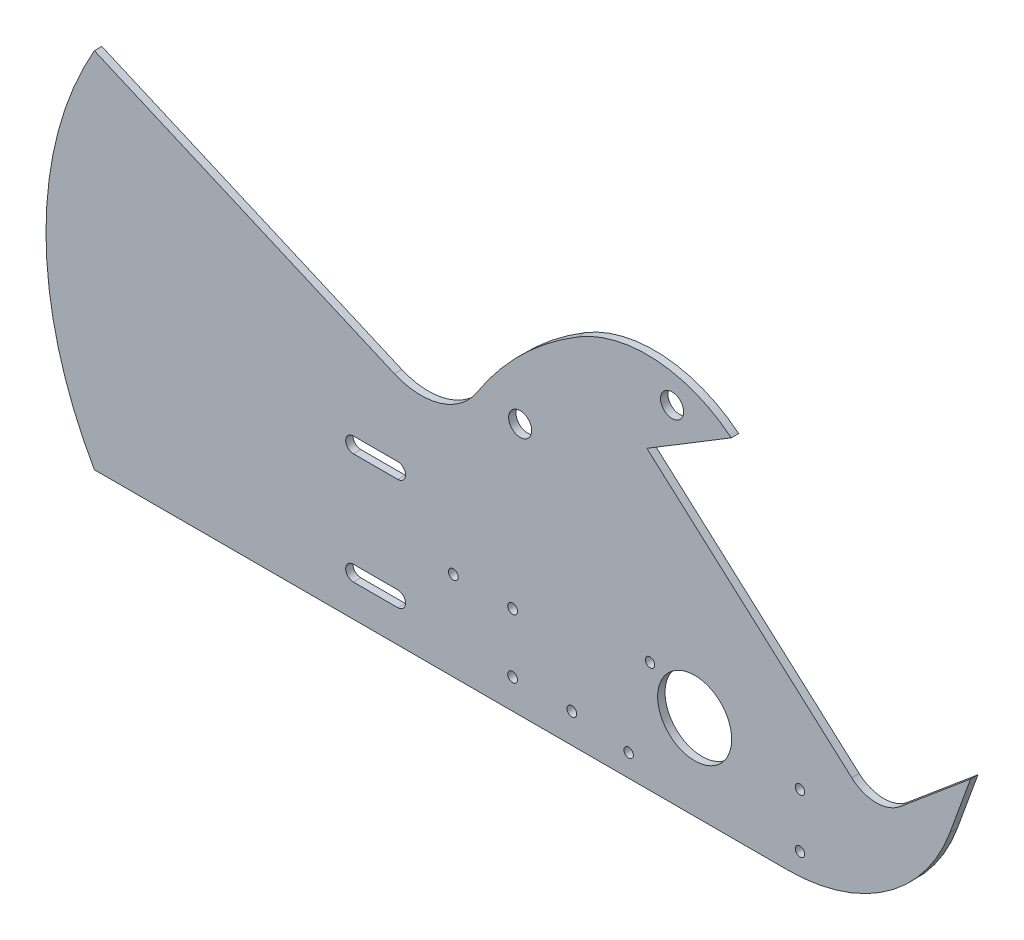
ISO-10303-21;
HEADER;
FILE_DESCRIPTION(('STEP AP214'),'2;1');
FILE_NAME('part.step','',(''),(''),'','','');
FILE_SCHEMA(('AUTOMOTIVE_DESIGN { 1 0 10303 214 1 1 1 1 }'));
ENDSEC;
DATA;
#1=APPLICATION_CONTEXT('core data for automotive mechanical design processes');
#2=APPLICATION_PROTOCOL_DEFINITION('international standard','automotive_design',2000,#1);
#3=PRODUCT_CONTEXT('',#1,'mechanical');
#4=PRODUCT('Part','Part','',(#3));
#5=PRODUCT_RELATED_PRODUCT_CATEGORY('part','',(#4));
#6=PRODUCT_DEFINITION_FORMATION('','',#4);
#7=PRODUCT_DEFINITION_CONTEXT('part definition',#1,'design');
#8=PRODUCT_DEFINITION('design','',#6,#7);
#9=PRODUCT_DEFINITION_SHAPE('','',#8);
#10=(LENGTH_UNIT() NAMED_UNIT(*) SI_UNIT(.MILLI.,.METRE.));
#11=(NAMED_UNIT(*) PLANE_ANGLE_UNIT() SI_UNIT($,.RADIAN.));
#12=(NAMED_UNIT(*) SI_UNIT($,.STERADIAN.) SOLID_ANGLE_UNIT());
#13=UNCERTAINTY_MEASURE_WITH_UNIT(LENGTH_MEASURE(1.E-05),#10,'distance_accuracy_value','');
#14=(GEOMETRIC_REPRESENTATION_CONTEXT(3) GLOBAL_UNCERTAINTY_ASSIGNED_CONTEXT((#13)) GLOBAL_UNIT_ASSIGNED_CONTEXT((#10,
#11,#12)) REPRESENTATION_CONTEXT('',''));
#15=CARTESIAN_POINT('',(0.,0.,0.));
#16=DIRECTION('',(0.,0.,1.));
#17=DIRECTION('',(1.,0.,0.));
#18=AXIS2_PLACEMENT_3D('',#15,#16,#17);
#19=CARTESIAN_POINT('',(-136.443129980913,87.2748774469459,3.175));
#20=DIRECTION('',(0.,0.,-1.));
#21=DIRECTION('',(-1.,0.,0.));
#22=AXIS2_PLACEMENT_3D('',#19,#20,#21);
#23=CYLINDRICAL_SURFACE('',#22,28.5749999999999);
#24=CARTESIAN_POINT('',(-136.443129980913,87.2748774469459,0.));
#25=DIRECTION('',(0.,0.,-1.));
#26=DIRECTION('',(1.,0.,0.));
#27=AXIS2_PLACEMENT_3D('',#24,#25,#26);
#28=CIRCLE('',#27,28.5749999999999);
#29=CARTESIAN_POINT('',(-112.371322470553,71.877517017828,0.));
#30=VERTEX_POINT('',#29);
#31=CARTESIAN_POINT('',(-147.787037556841,61.048051754369,0.));
#32=VERTEX_POINT('',#31);
#33=EDGE_CURVE('E258',#30,#32,#28,.T.);
#34=ORIENTED_EDGE('',*,*,#33,.T.);
#35=DIRECTION('',(0.,0.,-1.));
#36=VECTOR('',#35,1.);
#37=CARTESIAN_POINT('',(-147.787037556841,61.048051754369,3.175));
#38=LINE('',#37,#36);
#39=CARTESIAN_POINT('',(-147.787037556841,61.048051754369,3.175));
#40=VERTEX_POINT('',#39);
#41=EDGE_CURVE('E11',#40,#32,#38,.T.);
#42=ORIENTED_EDGE('',*,*,#41,.F.);
#43=CARTESIAN_POINT('',(-136.443129980913,87.2748774469459,3.175));
#44=DIRECTION('',(0.,0.,-1.));
#45=DIRECTION('',(1.,0.,0.));
#46=AXIS2_PLACEMENT_3D('',#43,#44,#45);
#47=CIRCLE('',#46,28.5749999999999);
#48=CARTESIAN_POINT('',(-112.371322470553,71.877517017828,3.175));
#49=VERTEX_POINT('',#48);
#50=EDGE_CURVE('E261',#49,#40,#47,.T.);
#51=ORIENTED_EDGE('',*,*,#50,.F.);
#52=DIRECTION('',(0.,0.,-1.));
#53=VECTOR('',#52,1.);
#54=CARTESIAN_POINT('',(-112.371322470553,71.877517017828,3.175));
#55=LINE('',#54,#53);
#56=EDGE_CURVE('E287',#49,#30,#55,.T.);
#57=ORIENTED_EDGE('',*,*,#56,.T.);
#58=EDGE_LOOP('',(#34,#42,#51,#57));
#59=FACE_BOUND('',#58,.T.);
#60=ADVANCED_FACE('F34',(#59),#23,.F.);
#61=CARTESIAN_POINT('',(-177.372260989397,73.8445694941068,3.175));
#62=DIRECTION('',(-0.396987141764733,-0.917824171218795,0.));
#63=DIRECTION('',(0.917824171218795,-0.396987141764733,0.));
#64=AXIS2_PLACEMENT_3D('',#61,#62,#63);
#65=PLANE('',#64);
#66=DIRECTION('',(-0.917824171218795,0.396987141764733,0.));
#67=VECTOR('',#66,1.);
#68=CARTESIAN_POINT('',(-177.372260989397,73.8445694941068,0.));
#69=LINE('',#68,#67);
#70=CARTESIAN_POINT('',(-276.451380272466,116.69933144761,0.));
#71=VERTEX_POINT('',#70);
#72=EDGE_CURVE('E290',#32,#71,#69,.T.);
#73=ORIENTED_EDGE('',*,*,#72,.T.);
#74=DIRECTION('',(0.,0.,-1.));
#75=VECTOR('',#74,1.);
#76=CARTESIAN_POINT('',(-276.451380272466,116.69933144761,3.175));
#77=LINE('',#76,#75);
#78=CARTESIAN_POINT('',(-276.451380272466,116.69933144761,3.175));
#79=VERTEX_POINT('',#78);
#80=EDGE_CURVE('E41',#79,#71,#77,.T.);
#81=ORIENTED_EDGE('',*,*,#80,.F.);
#82=DIRECTION('',(-0.917824171218795,0.396987141764733,0.));
#83=VECTOR('',#82,1.);
#84=CARTESIAN_POINT('',(-177.372260989397,73.8445694941068,3.175));
#85=LINE('',#84,#83);
#86=EDGE_CURVE('E264',#40,#79,#85,.T.);
#87=ORIENTED_EDGE('',*,*,#86,.F.);
#88=ORIENTED_EDGE('',*,*,#41,.T.);
#89=EDGE_LOOP('',(#73,#81,#87,#88));
#90=FACE_BOUND('',#89,.T.);
#91=ADVANCED_FACE('F366',(#90),#65,.F.);
#92=CARTESIAN_POINT('',(-140.78574748454,38.8840092455691,3.175));
#93=DIRECTION('',(0.,0.,-1.));
#94=DIRECTION('',(-1.,0.,0.));
#95=AXIS2_PLACEMENT_3D('',#92,#93,#94);
#96=CYLINDRICAL_SURFACE('',#95,156.39817226923);
#97=CARTESIAN_POINT('',(-140.78574748454,38.8840092455691,0.));
#98=DIRECTION('',(0.,0.,1.));
#99=DIRECTION('',(1.,0.,0.));
#100=AXIS2_PLACEMENT_3D('',#97,#98,#99);
#101=CIRCLE('',#100,156.39817226923);
#102=CARTESIAN_POINT('',(-276.451380272466,-38.9313129564715,0.));
#103=VERTEX_POINT('',#102);
#104=EDGE_CURVE('E292',#71,#103,#101,.T.);
#105=ORIENTED_EDGE('',*,*,#104,.T.);
#106=DIRECTION('',(0.,0.,-1.));
#107=VECTOR('',#106,1.);
#108=CARTESIAN_POINT('',(-276.451380272466,-38.9313129564715,3.175));
#109=LINE('',#108,#107);
#110=CARTESIAN_POINT('',(-276.451380272466,-38.9313129564715,3.175));
#111=VERTEX_POINT('',#110);
#112=EDGE_CURVE('E338',#111,#103,#109,.T.);
#113=ORIENTED_EDGE('',*,*,#112,.F.);
#114=CARTESIAN_POINT('',(-140.78574748454,38.8840092455691,3.175));
#115=DIRECTION('',(0.,0.,1.));
#116=DIRECTION('',(1.,0.,0.));
#117=AXIS2_PLACEMENT_3D('',#114,#115,#116);
#118=CIRCLE('',#117,156.39817226923);
#119=EDGE_CURVE('E267',#79,#111,#118,.T.);
#120=ORIENTED_EDGE('',*,*,#119,.F.);
#121=ORIENTED_EDGE('',*,*,#80,.T.);
#122=EDGE_LOOP('',(#105,#113,#120,#121));
#123=FACE_BOUND('',#122,.T.);
#124=ADVANCED_FACE('F345',(#123),#96,.T.);
#125=CARTESIAN_POINT('',(-127.585439756714,-38.9313129564715,3.175));
#126=DIRECTION('',(0.,1.,0.));
#127=DIRECTION('',(-1.,0.,0.));
#128=AXIS2_PLACEMENT_3D('',#125,#126,#127);
#129=PLANE('',#128);
#130=DIRECTION('',(1.,0.,0.));
#131=VECTOR('',#130,1.);
#132=CARTESIAN_POINT('',(-127.585439756714,-38.9313129564715,0.));
#133=LINE('',#132,#131);
#134=CARTESIAN_POINT('',(20.8959123706932,-38.9313129564715,0.));
#135=VERTEX_POINT('',#134);
#136=EDGE_CURVE('E295',#103,#135,#133,.T.);
#137=ORIENTED_EDGE('',*,*,#136,.T.);
#138=DIRECTION('',(0.,0.,-1.));
#139=VECTOR('',#138,1.);
#140=CARTESIAN_POINT('',(20.8959123706932,-38.9313129564715,3.175));
#141=LINE('',#140,#139);
#142=CARTESIAN_POINT('',(20.8959123706932,-38.9313129564715,3.175));
#143=VERTEX_POINT('',#142);
#144=EDGE_CURVE('E335',#143,#135,#141,.T.);
#145=ORIENTED_EDGE('',*,*,#144,.F.);
#146=DIRECTION('',(1.,0.,0.));
#147=VECTOR('',#146,1.);
#148=CARTESIAN_POINT('',(-127.585439756714,-38.9313129564715,3.175));
#149=LINE('',#148,#147);
#150=EDGE_CURVE('E269',#111,#143,#149,.T.);
#151=ORIENTED_EDGE('',*,*,#150,.F.);
#152=ORIENTED_EDGE('',*,*,#112,.T.);
#153=EDGE_LOOP('',(#137,#145,#151,#152));
#154=FACE_BOUND('',#153,.T.);
#155=ADVANCED_FACE('F355',(#154),#129,.F.);
#156=CARTESIAN_POINT('',(20.8959123706932,35.0312861178766,3.175));
#157=DIRECTION('',(0.,0.,-1.));
#158=DIRECTION('',(-1.,0.,0.));
#159=AXIS2_PLACEMENT_3D('',#156,#157,#158);
#160=CYLINDRICAL_SURFACE('',#159,73.9625990743481);
#161=CARTESIAN_POINT('',(20.8959123706932,35.0312861178766,0.));
#162=DIRECTION('',(0.,0.,1.));
#163=DIRECTION('',(1.,0.,0.));
#164=AXIS2_PLACEMENT_3D('',#161,#162,#163);
#165=CIRCLE('',#164,73.9625990743481);
#166=CARTESIAN_POINT('',(90.3980209350046,9.7345873817289,0.));
#167=VERTEX_POINT('',#166);
#168=EDGE_CURVE('E297',#135,#167,#165,.T.);
#169=ORIENTED_EDGE('',*,*,#168,.T.);
#170=DIRECTION('',(0.,0.,-1.));
#171=VECTOR('',#170,1.);
#172=CARTESIAN_POINT('',(90.3980209350046,9.7345873817289,3.175));
#173=LINE('',#172,#171);
#174=CARTESIAN_POINT('',(90.3980209350046,9.7345873817289,3.175));
#175=VERTEX_POINT('',#174);
#176=EDGE_CURVE('E332',#175,#167,#173,.T.);
#177=ORIENTED_EDGE('',*,*,#176,.F.);
#178=CARTESIAN_POINT('',(20.8959123706932,35.0312861178766,3.175));
#179=DIRECTION('',(0.,0.,1.));
#180=DIRECTION('',(1.,0.,0.));
#181=AXIS2_PLACEMENT_3D('',#178,#179,#180);
#182=CIRCLE('',#181,73.9625990743481);
#183=EDGE_CURVE('E271',#143,#175,#182,.T.);
#184=ORIENTED_EDGE('',*,*,#183,.F.);
#185=ORIENTED_EDGE('',*,*,#144,.T.);
#186=EDGE_LOOP('',(#169,#177,#184,#185));
#187=FACE_BOUND('',#186,.T.);
#188=ADVANCED_FACE('F359',(#187),#160,.T.);
#189=CARTESIAN_POINT('',(99.2640081454237,34.0936870435286,3.175));
#190=DIRECTION('',(-0.939692620785907,0.342020143325672,0.));
#191=DIRECTION('',(-0.342020143325672,-0.939692620785907,0.));
#192=AXIS2_PLACEMENT_3D('',#189,#190,#191);
#193=PLANE('',#192);
#194=DIRECTION('',(0.342020143325672,0.939692620785907,0.));
#195=VECTOR('',#194,1.);
#196=CARTESIAN_POINT('',(99.2640081454237,34.0936870435286,0.));
#197=LINE('',#196,#195);
#198=CARTESIAN_POINT('',(99.2640081454237,34.0936870435286,0.));
#199=VERTEX_POINT('',#198);
#200=EDGE_CURVE('E299',#167,#199,#197,.T.);
#201=ORIENTED_EDGE('',*,*,#200,.T.);
#202=DIRECTION('',(0.,0.,-1.));
#203=VECTOR('',#202,1.);
#204=CARTESIAN_POINT('',(99.2640081454237,34.0936870435286,3.175));
#205=LINE('',#204,#203);
#206=CARTESIAN_POINT('',(99.2640081454237,34.0936870435286,3.175));
#207=VERTEX_POINT('',#206);
#208=EDGE_CURVE('E329',#207,#199,#205,.T.);
#209=ORIENTED_EDGE('',*,*,#208,.F.);
#210=DIRECTION('',(0.342020143325672,0.939692620785907,0.));
#211=VECTOR('',#210,1.);
#212=CARTESIAN_POINT('',(99.2640081454237,34.0936870435286,3.175));
#213=LINE('',#212,#211);
#214=EDGE_CURVE('E273',#175,#207,#213,.T.);
#215=ORIENTED_EDGE('',*,*,#214,.F.);
#216=ORIENTED_EDGE('',*,*,#176,.T.);
#217=EDGE_LOOP('',(#201,#209,#215,#216));
#218=FACE_BOUND('',#217,.T.);
#219=ADVANCED_FACE('F399',(#218),#193,.F.);
#220=CARTESIAN_POINT('',(69.0694214876391,8.75742051543091,3.175));
#221=DIRECTION('',(0.642787609686541,-0.766044443118976,0.));
#222=DIRECTION('',(0.766044443118977,0.642787609686541,0.));
#223=AXIS2_PLACEMENT_3D('',#220,#221,#222);
#224=PLANE('',#223);
#225=DIRECTION('',(-0.766044443118976,-0.642787609686541,0.));
#226=VECTOR('',#225,1.);
#227=CARTESIAN_POINT('',(69.0694214876391,8.75742051543091,0.));
#228=LINE('',#227,#226);
#229=CARTESIAN_POINT('',(69.0694214876391,8.75742051543091,0.));
#230=VERTEX_POINT('',#229);
#231=EDGE_CURVE('E301',#199,#230,#228,.T.);
#232=ORIENTED_EDGE('',*,*,#231,.T.);
#233=DIRECTION('',(0.,0.,-1.));
#234=VECTOR('',#233,1.);
#235=CARTESIAN_POINT('',(69.0694214876391,8.75742051543091,3.175));
#236=LINE('',#235,#234);
#237=CARTESIAN_POINT('',(69.0694214876391,8.75742051543091,3.175));
#238=VERTEX_POINT('',#237);
#239=EDGE_CURVE('E326',#238,#230,#236,.T.);
#240=ORIENTED_EDGE('',*,*,#239,.F.);
#241=DIRECTION('',(-0.766044443118976,-0.642787609686541,0.));
#242=VECTOR('',#241,1.);
#243=CARTESIAN_POINT('',(69.0694214876391,8.75742051543091,3.175));
#244=LINE('',#243,#242);
#245=EDGE_CURVE('E275',#207,#238,#244,.T.);
#246=ORIENTED_EDGE('',*,*,#245,.F.);
#247=ORIENTED_EDGE('',*,*,#208,.T.);
#248=EDGE_LOOP('',(#232,#240,#246,#247));
#249=FACE_BOUND('',#248,.T.);
#250=ADVANCED_FACE('F397',(#249),#224,.F.);
#251=CARTESIAN_POINT('',(58.8651681838657,20.9183760499451,3.175));
#252=DIRECTION('',(0.,0.,-1.));
#253=DIRECTION('',(-1.,0.,0.));
#254=AXIS2_PLACEMENT_3D('',#251,#252,#253);
#255=CYLINDRICAL_SURFACE('',#254,15.8750000000003);
#256=CARTESIAN_POINT('',(58.8651681838657,20.9183760499451,0.));
#257=DIRECTION('',(0.,0.,-1.));
#258=DIRECTION('',(-1.,0.,0.));
#259=AXIS2_PLACEMENT_3D('',#256,#257,#258);
#260=CIRCLE('',#259,15.8750000000003);
#261=CARTESIAN_POINT('',(48.2932034747206,9.07569108459201,0.));
#262=VERTEX_POINT('',#261);
#263=EDGE_CURVE('E303',#230,#262,#260,.T.);
#264=ORIENTED_EDGE('',*,*,#263,.T.);
#265=DIRECTION('',(0.,0.,-1.));
#266=VECTOR('',#265,1.);
#267=CARTESIAN_POINT('',(48.2932034747206,9.07569108459201,3.175));
#268=LINE('',#267,#266);
#269=CARTESIAN_POINT('',(48.2932034747206,9.07569108459201,3.175));
#270=VERTEX_POINT('',#269);
#271=EDGE_CURVE('E323',#270,#262,#268,.T.);
#272=ORIENTED_EDGE('',*,*,#271,.F.);
#273=CARTESIAN_POINT('',(58.8651681838657,20.9183760499451,3.175));
#274=DIRECTION('',(0.,0.,-1.));
#275=DIRECTION('',(-1.,0.,0.));
#276=AXIS2_PLACEMENT_3D('',#273,#274,#275);
#277=CIRCLE('',#276,15.8750000000003);
#278=EDGE_CURVE('E277',#238,#270,#277,.T.);
#279=ORIENTED_EDGE('',*,*,#278,.F.);
#280=ORIENTED_EDGE('',*,*,#239,.T.);
#281=EDGE_LOOP('',(#264,#272,#279,#280));
#282=FACE_BOUND('',#281,.T.);
#283=ADVANCED_FACE('F393',(#282),#255,.F.);
#284=CARTESIAN_POINT('',(48.2932034747204,9.07569108459179,3.175));
#285=DIRECTION('',(-0.665950532859554,-0.745995903329285,0.));
#286=DIRECTION('',(0.745995903329285,-0.665950532859554,0.));
#287=AXIS2_PLACEMENT_3D('',#284,#285,#286);
#288=PLANE('',#287);
#289=DIRECTION('',(-0.745995903329285,0.665950532859554,0.));
#290=VECTOR('',#289,1.);
#291=CARTESIAN_POINT('',(48.2932034747204,9.07569108459179,0.));
#292=LINE('',#291,#290);
#293=CARTESIAN_POINT('',(-39.5356826795893,87.4805365722031,0.));
#294=VERTEX_POINT('',#293);
#295=EDGE_CURVE('E305',#262,#294,#292,.T.);
#296=ORIENTED_EDGE('',*,*,#295,.T.);
#297=DIRECTION('',(0.,0.,-1.));
#298=VECTOR('',#297,1.);
#299=CARTESIAN_POINT('',(-39.5356826795893,87.4805365722031,3.175));
#300=LINE('',#299,#298);
#301=CARTESIAN_POINT('',(-39.5356826795893,87.4805365722031,3.175));
#302=VERTEX_POINT('',#301);
#303=EDGE_CURVE('E320',#302,#294,#300,.T.);
#304=ORIENTED_EDGE('',*,*,#303,.F.);
#305=DIRECTION('',(-0.745995903329285,0.665950532859554,0.));
#306=VECTOR('',#305,1.);
#307=CARTESIAN_POINT('',(48.2932034747204,9.07569108459179,3.175));
#308=LINE('',#307,#306);
#309=EDGE_CURVE('E279',#270,#302,#308,.T.);
#310=ORIENTED_EDGE('',*,*,#309,.F.);
#311=ORIENTED_EDGE('',*,*,#271,.T.);
#312=EDGE_LOOP('',(#296,#304,#310,#311));
#313=FACE_BOUND('',#312,.T.);
#314=ADVANCED_FACE('F388',(#313),#288,.F.);
#315=CARTESIAN_POINT('',(-3.34071269482263,109.466412575739,3.175));
#316=DIRECTION('',(-0.51915684100474,0.854678989116955,0.));
#317=DIRECTION('',(-0.854678989116955,-0.51915684100474,0.));
#318=AXIS2_PLACEMENT_3D('',#315,#316,#317);
#319=PLANE('',#318);
#320=DIRECTION('',(0.854678989116955,0.51915684100474,0.));
#321=VECTOR('',#320,1.);
#322=CARTESIAN_POINT('',(-3.34071269482263,109.466412575739,0.));
#323=LINE('',#322,#321);
#324=CARTESIAN_POINT('',(-3.34071269482263,109.466412575739,0.));
#325=VERTEX_POINT('',#324);
#326=EDGE_CURVE('E307',#294,#325,#323,.T.);
#327=ORIENTED_EDGE('',*,*,#326,.T.);
#328=DIRECTION('',(0.,0.,-1.));
#329=VECTOR('',#328,1.);
#330=CARTESIAN_POINT('',(-3.34071269482263,109.466412575739,3.175));
#331=LINE('',#330,#329);
#332=CARTESIAN_POINT('',(-3.34071269482263,109.466412575739,3.175));
#333=VERTEX_POINT('',#332);
#334=EDGE_CURVE('E317',#333,#325,#331,.T.);
#335=ORIENTED_EDGE('',*,*,#334,.F.);
#336=DIRECTION('',(0.854678989116955,0.51915684100474,0.));
#337=VECTOR('',#336,1.);
#338=CARTESIAN_POINT('',(-3.34071269482263,109.466412575739,3.175));
#339=LINE('',#338,#337);
#340=EDGE_CURVE('E281',#302,#333,#339,.T.);
#341=ORIENTED_EDGE('',*,*,#340,.F.);
#342=ORIENTED_EDGE('',*,*,#303,.T.);
#343=EDGE_LOOP('',(#327,#335,#341,#342));
#344=FACE_BOUND('',#343,.T.);
#345=ADVANCED_FACE('F382',(#344),#319,.F.);
#346=CARTESIAN_POINT('',(-39.5133931875119,65.0502204318948,3.175));
#347=DIRECTION('',(0.,0.,-1.));
#348=DIRECTION('',(-1.,0.,0.));
#349=AXIS2_PLACEMENT_3D('',#346,#347,#348);
#350=CYLINDRICAL_SURFACE('',#349,57.2822916666667);
#351=CARTESIAN_POINT('',(-39.5133931875119,65.0502204318948,0.));
#352=DIRECTION('',(0.,0.,1.));
#353=DIRECTION('',(-1.,0.,0.));
#354=AXIS2_PLACEMENT_3D('',#351,#352,#353);
#355=CIRCLE('',#354,57.2822916666667);
#356=CARTESIAN_POINT('',(-69.2518867746906,114.008191567864,0.));
#357=VERTEX_POINT('',#356);
#358=EDGE_CURVE('E309',#325,#357,#355,.T.);
#359=ORIENTED_EDGE('',*,*,#358,.T.);
#360=DIRECTION('',(0.,0.,-1.));
#361=VECTOR('',#360,1.);
#362=CARTESIAN_POINT('',(-69.2518867746906,114.008191567864,3.175));
#363=LINE('',#362,#361);
#364=CARTESIAN_POINT('',(-69.2518867746906,114.008191567864,3.175));
#365=VERTEX_POINT('',#364);
#366=EDGE_CURVE('E314',#365,#357,#363,.T.);
#367=ORIENTED_EDGE('',*,*,#366,.F.);
#368=CARTESIAN_POINT('',(-39.5133931875119,65.0502204318948,3.175));
#369=DIRECTION('',(0.,0.,1.));
#370=DIRECTION('',(-1.,0.,0.));
#371=AXIS2_PLACEMENT_3D('',#368,#369,#370);
#372=CIRCLE('',#371,57.2822916666667);
#373=EDGE_CURVE('E283',#333,#365,#372,.T.);
#374=ORIENTED_EDGE('',*,*,#373,.F.);
#375=ORIENTED_EDGE('',*,*,#334,.T.);
#376=EDGE_LOOP('',(#359,#367,#374,#375));
#377=FACE_BOUND('',#376,.T.);
#378=ADVANCED_FACE('F378',(#377),#350,.T.);
#379=CARTESIAN_POINT('',(3.37230243729891E-12,-1.56819002228303E-12,3.175));
#380=DIRECTION('',(0.,0.,-1.));
#381=DIRECTION('',(-1.,0.,0.));
#382=AXIS2_PLACEMENT_3D('',#379,#380,#381);
#383=CYLINDRICAL_SURFACE('',#382,133.392996691844);
#384=CARTESIAN_POINT('',(3.37230243729891E-12,-1.56819002228303E-12,0.));
#385=DIRECTION('',(0.,0.,1.));
#386=DIRECTION('',(-1.,0.,0.));
#387=AXIS2_PLACEMENT_3D('',#384,#385,#386);
#388=CIRCLE('',#387,133.392996691844);
#389=EDGE_CURVE('E265',#357,#30,#388,.T.);
#390=ORIENTED_EDGE('',*,*,#389,.T.);
#391=ORIENTED_EDGE('',*,*,#56,.F.);
#392=CARTESIAN_POINT('',(3.37230243729891E-12,-1.56819002228303E-12,3.175));
#393=DIRECTION('',(0.,0.,1.));
#394=DIRECTION('',(-1.,0.,0.));
#395=AXIS2_PLACEMENT_3D('',#392,#393,#394);
#396=CIRCLE('',#395,133.392996691844);
#397=EDGE_CURVE('E285',#365,#49,#396,.T.);
#398=ORIENTED_EDGE('',*,*,#397,.F.);
#399=ORIENTED_EDGE('',*,*,#366,.T.);
#400=EDGE_LOOP('',(#390,#391,#398,#399));
#401=FACE_BOUND('',#400,.T.);
#402=ADVANCED_FACE('F373',(#401),#383,.T.);
#403=CARTESIAN_POINT('',(-136.443129980913,87.2748774469459,3.175));
#404=DIRECTION('',(0.,0.,1.));
#405=DIRECTION('',(1.,0.,0.));
#406=AXIS2_PLACEMENT_3D('',#403,#404,#405);
#407=PLANE('',#406);
#408=CARTESIAN_POINT('',(-28.7407126948226,108.897095010061,3.175));
#409=DIRECTION('',(0.,0.,1.));
#410=DIRECTION('',(1.,0.,0.));
#411=AXIS2_PLACEMENT_3D('',#408,#409,#410);
#412=CIRCLE('',#411,4.961001);
#413=CARTESIAN_POINT('',(-23.7797116948226,108.897095010061,3.175));
#414=VERTEX_POINT('',#413);
#415=EDGE_CURVE('E692',#414,#414,#412,.T.);
#416=ORIENTED_EDGE('',*,*,#415,.F.);
#417=EDGE_LOOP('',(#416));
#418=FACE_BOUND('',#417,.T.);
#419=CARTESIAN_POINT('',(-93.8672516655346,69.3373437254997,3.175));
#420=DIRECTION('',(0.,0.,1.));
#421=DIRECTION('',(1.,0.,0.));
#422=AXIS2_PLACEMENT_3D('',#419,#420,#421);
#423=CIRCLE('',#422,4.96100099999999);
#424=CARTESIAN_POINT('',(-88.9062506655346,69.3373437254997,3.175));
#425=VERTEX_POINT('',#424);
#426=EDGE_CURVE('E694',#425,#425,#423,.T.);
#427=ORIENTED_EDGE('',*,*,#426,.F.);
#428=EDGE_LOOP('',(#427));
#429=FACE_BOUND('',#428,.T.);
#430=CARTESIAN_POINT('',(-38.1908667013556,8.69368704352845,3.175));
#431=DIRECTION('',(0.,0.,1.));
#432=DIRECTION('',(1.,0.,0.));
#433=AXIS2_PLACEMENT_3D('',#430,#431,#432);
#434=CIRCLE('',#433,2.01929999999999);
#435=CARTESIAN_POINT('',(-36.1715667013556,8.69368704352845,3.175));
#436=VERTEX_POINT('',#435);
#437=EDGE_CURVE('E703',#436,#436,#434,.T.);
#438=ORIENTED_EDGE('',*,*,#437,.F.);
#439=EDGE_LOOP('',(#438));
#440=FACE_BOUND('',#439,.T.);
#441=CARTESIAN_POINT('',(-47.354412394006,-29.4063129564715,3.175));
#442=DIRECTION('',(0.,0.,1.));
#443=DIRECTION('',(1.,0.,0.));
#444=AXIS2_PLACEMENT_3D('',#441,#442,#443);
#445=CIRCLE('',#444,2.01929999999999);
#446=CARTESIAN_POINT('',(-45.335112394006,-29.4063129564715,3.175));
#447=VERTEX_POINT('',#446);
#448=EDGE_CURVE('E711',#447,#447,#445,.T.);
#449=ORIENTED_EDGE('',*,*,#448,.F.);
#450=EDGE_LOOP('',(#449));
#451=FACE_BOUND('',#450,.T.);
#452=CARTESIAN_POINT('',(26.1115835914491,-29.4063129564716,3.175));
#453=DIRECTION('',(0.,0.,1.));
#454=DIRECTION('',(1.,0.,0.));
#455=AXIS2_PLACEMENT_3D('',#452,#453,#454);
#456=CIRCLE('',#455,2.0193);
#457=CARTESIAN_POINT('',(28.1308835914491,-29.4063129564716,3.175));
#458=VERTEX_POINT('',#457);
#459=EDGE_CURVE('E702',#458,#458,#456,.T.);
#460=ORIENTED_EDGE('',*,*,#459,.F.);
#461=EDGE_LOOP('',(#460));
#462=FACE_BOUND('',#461,.T.);
#463=CARTESIAN_POINT('',(26.1115835914491,-6.33057427050274,3.175));
#464=DIRECTION('',(0.,0.,1.));
#465=DIRECTION('',(1.,0.,0.));
#466=AXIS2_PLACEMENT_3D('',#463,#464,#465);
#467=CIRCLE('',#466,2.0193);
#468=CARTESIAN_POINT('',(28.1308835914491,-6.33057427050274,3.175));
#469=VERTEX_POINT('',#468);
#470=EDGE_CURVE('E710',#469,#469,#467,.T.);
#471=ORIENTED_EDGE('',*,*,#470,.F.);
#472=EDGE_LOOP('',(#471));
#473=FACE_BOUND('',#472,.T.);
#474=CARTESIAN_POINT('',(-146.337218926204,25.8386870435285,3.175));
#475=DIRECTION('',(0.,0.,1.));
#476=DIRECTION('',(1.,0.,0.));
#477=AXIS2_PLACEMENT_3D('',#474,#475,#476);
#478=CIRCLE('',#477,3.302);
#479=CARTESIAN_POINT('',(-146.337218926204,22.5366870435285,3.175));
#480=VERTEX_POINT('',#479);
#481=CARTESIAN_POINT('',(-146.337218926204,29.1406870435285,3.175));
#482=VERTEX_POINT('',#481);
#483=EDGE_CURVE('E48',#480,#482,#478,.T.);
#484=ORIENTED_EDGE('',*,*,#483,.F.);
#485=DIRECTION('',(1.,0.,0.));
#486=VECTOR('',#485,1.);
#487=CARTESIAN_POINT('',(-165.387218926204,22.5366870435285,3.175));
#488=LINE('',#487,#486);
#489=CARTESIAN_POINT('',(-165.387218926204,22.5366870435285,3.175));
#490=VERTEX_POINT('',#489);
#491=EDGE_CURVE('E189',#490,#480,#488,.T.);
#492=ORIENTED_EDGE('',*,*,#491,.F.);
#493=CARTESIAN_POINT('',(-165.387218926204,25.8386870435285,3.175));
#494=DIRECTION('',(0.,0.,1.));
#495=DIRECTION('',(1.,0.,0.));
#496=AXIS2_PLACEMENT_3D('',#493,#494,#495);
#497=CIRCLE('',#496,3.302);
#498=CARTESIAN_POINT('',(-165.387218926204,29.1406870435285,3.175));
#499=VERTEX_POINT('',#498);
#500=EDGE_CURVE('E173',#499,#490,#497,.T.);
#501=ORIENTED_EDGE('',*,*,#500,.F.);
#502=DIRECTION('',(-1.,0.,0.));
#503=VECTOR('',#502,1.);
#504=CARTESIAN_POINT('',(-165.387218926204,29.1406870435285,3.175));
#505=LINE('',#504,#503);
#506=EDGE_CURVE('E182',#482,#499,#505,.T.);
#507=ORIENTED_EDGE('',*,*,#506,.F.);
#508=EDGE_LOOP('',(#484,#492,#501,#507));
#509=FACE_BOUND('',#508,.T.);
#510=CARTESIAN_POINT('',(-165.387218926204,-21.7863129564715,3.175));
#511=DIRECTION('',(0.,0.,1.));
#512=DIRECTION('',(1.,0.,0.));
#513=AXIS2_PLACEMENT_3D('',#510,#511,#512);
#514=CIRCLE('',#513,3.302);
#515=CARTESIAN_POINT('',(-165.387218926204,-18.4843129564715,3.175));
#516=VERTEX_POINT('',#515);
#517=CARTESIAN_POINT('',(-165.387218926204,-25.0883129564715,3.175));
#518=VERTEX_POINT('',#517);
#519=EDGE_CURVE('E200',#516,#518,#514,.T.);
#520=ORIENTED_EDGE('',*,*,#519,.F.);
#521=DIRECTION('',(-1.,0.,0.));
#522=VECTOR('',#521,1.);
#523=CARTESIAN_POINT('',(-165.387218926204,-18.4843129564715,3.175));
#524=LINE('',#523,#522);
#525=CARTESIAN_POINT('',(-146.337218926204,-18.4843129564715,3.175));
#526=VERTEX_POINT('',#525);
#527=EDGE_CURVE('E218',#526,#516,#524,.T.);
#528=ORIENTED_EDGE('',*,*,#527,.F.);
#529=CARTESIAN_POINT('',(-146.337218926204,-21.7863129564715,3.175));
#530=DIRECTION('',(0.,0.,1.));
#531=DIRECTION('',(1.,0.,0.));
#532=AXIS2_PLACEMENT_3D('',#529,#530,#531);
#533=CIRCLE('',#532,3.302);
#534=CARTESIAN_POINT('',(-146.337218926204,-25.0883129564715,3.175));
#535=VERTEX_POINT('',#534);
#536=EDGE_CURVE('E215',#535,#526,#533,.T.);
#537=ORIENTED_EDGE('',*,*,#536,.F.);
#538=DIRECTION('',(1.,0.,0.));
#539=VECTOR('',#538,1.);
#540=CARTESIAN_POINT('',(-165.387218926204,-25.0883129564715,3.175));
#541=LINE('',#540,#539);
#542=EDGE_CURVE('E212',#518,#535,#541,.T.);
#543=ORIENTED_EDGE('',*,*,#542,.F.);
#544=EDGE_LOOP('',(#520,#528,#537,#543));
#545=FACE_BOUND('',#544,.T.);
#546=CARTESIAN_POINT('',(-71.71436,-26.2313129564715,3.175));
#547=DIRECTION('',(0.,0.,1.));
#548=DIRECTION('',(1.,0.,0.));
#549=AXIS2_PLACEMENT_3D('',#546,#547,#548);
#550=CIRCLE('',#549,2.0955);
#551=CARTESIAN_POINT('',(-69.61886,-26.2313129564715,3.175));
#552=VERTEX_POINT('',#551);
#553=EDGE_CURVE('E235',#552,#552,#550,.T.);
#554=ORIENTED_EDGE('',*,*,#553,.F.);
#555=EDGE_LOOP('',(#554));
#556=FACE_BOUND('',#555,.T.);
#557=CARTESIAN_POINT('',(-122.51436,-0.831312956471497,3.175));
#558=DIRECTION('',(0.,0.,1.));
#559=DIRECTION('',(1.,0.,0.));
#560=AXIS2_PLACEMENT_3D('',#557,#558,#559);
#561=CIRCLE('',#560,2.0955);
#562=CARTESIAN_POINT('',(-120.41886,-0.831312956471497,3.175));
#563=VERTEX_POINT('',#562);
#564=EDGE_CURVE('E241',#563,#563,#561,.T.);
#565=ORIENTED_EDGE('',*,*,#564,.F.);
#566=EDGE_LOOP('',(#565));
#567=FACE_BOUND('',#566,.T.);
#568=CARTESIAN_POINT('',(-97.11436,-0.831312956471497,3.175));
#569=DIRECTION('',(0.,0.,1.));
#570=DIRECTION('',(1.,0.,0.));
#571=AXIS2_PLACEMENT_3D('',#568,#569,#570);
#572=CIRCLE('',#571,2.0955);
#573=CARTESIAN_POINT('',(-95.01886,-0.831312956471497,3.175));
#574=VERTEX_POINT('',#573);
#575=EDGE_CURVE('E230',#574,#574,#572,.T.);
#576=ORIENTED_EDGE('',*,*,#575,.F.);
#577=EDGE_LOOP('',(#576));
#578=FACE_BOUND('',#577,.T.);
#579=CARTESIAN_POINT('',(-97.11436,-26.2313129564715,3.175));
#580=DIRECTION('',(0.,0.,1.));
#581=DIRECTION('',(1.,0.,0.));
#582=AXIS2_PLACEMENT_3D('',#579,#580,#581);
#583=CIRCLE('',#582,2.0955);
#584=CARTESIAN_POINT('',(-95.01886,-26.2313129564715,3.175));
#585=VERTEX_POINT('',#584);
#586=EDGE_CURVE('E234',#585,#585,#583,.T.);
#587=ORIENTED_EDGE('',*,*,#586,.F.);
#588=EDGE_LOOP('',(#587));
#589=FACE_BOUND('',#588,.T.);
#590=CARTESIAN_POINT('',(-19.051033526,-2.4188129564715,3.175));
#591=DIRECTION('',(0.,0.,1.));
#592=DIRECTION('',(1.,0.,0.));
#593=AXIS2_PLACEMENT_3D('',#590,#591,#592);
#594=CIRCLE('',#593,15.875);
#595=CARTESIAN_POINT('',(-3.17603352599999,-2.4188129564715,3.175));
#596=VERTEX_POINT('',#595);
#597=EDGE_CURVE('E255',#596,#596,#594,.T.);
#598=ORIENTED_EDGE('',*,*,#597,.F.);
#599=EDGE_LOOP('',(#598));
#600=FACE_BOUND('',#599,.T.);
#601=ORIENTED_EDGE('',*,*,#50,.T.);
#602=ORIENTED_EDGE('',*,*,#86,.T.);
#603=ORIENTED_EDGE('',*,*,#119,.T.);
#604=ORIENTED_EDGE('',*,*,#150,.T.);
#605=ORIENTED_EDGE('',*,*,#183,.T.);
#606=ORIENTED_EDGE('',*,*,#214,.T.);
#607=ORIENTED_EDGE('',*,*,#245,.T.);
#608=ORIENTED_EDGE('',*,*,#278,.T.);
#609=ORIENTED_EDGE('',*,*,#309,.T.);
#610=ORIENTED_EDGE('',*,*,#340,.T.);
#611=ORIENTED_EDGE('',*,*,#373,.T.);
#612=ORIENTED_EDGE('',*,*,#397,.T.);
#613=EDGE_LOOP('',(#601,#602,#603,#604,#605,#606,#607,#608,#609,#610,#611,#612));
#614=FACE_BOUND('',#613,.T.);
#615=ADVANCED_FACE('F186',(#418,#429,#440,#451,#462,#473,#509,#545,#556,#567,#578,#589,#600,
#614),#407,.T.);
#616=CARTESIAN_POINT('',(-136.443129980913,87.2748774469459,0.));
#617=DIRECTION('',(0.,0.,1.));
#618=DIRECTION('',(1.,0.,0.));
#619=AXIS2_PLACEMENT_3D('',#616,#617,#618);
#620=PLANE('',#619);
#621=CARTESIAN_POINT('',(-28.7407126948226,108.897095010061,0.));
#622=DIRECTION('',(0.,0.,1.));
#623=DIRECTION('',(1.,0.,0.));
#624=AXIS2_PLACEMENT_3D('',#621,#622,#623);
#625=CIRCLE('',#624,4.961001);
#626=CARTESIAN_POINT('',(-23.7797116948226,108.897095010061,0.));
#627=VERTEX_POINT('',#626);
#628=EDGE_CURVE('E689',#627,#627,#625,.T.);
#629=ORIENTED_EDGE('',*,*,#628,.T.);
#630=EDGE_LOOP('',(#629));
#631=FACE_BOUND('',#630,.T.);
#632=CARTESIAN_POINT('',(-93.8672516655346,69.3373437254997,0.));
#633=DIRECTION('',(0.,0.,1.));
#634=DIRECTION('',(1.,0.,0.));
#635=AXIS2_PLACEMENT_3D('',#632,#633,#634);
#636=CIRCLE('',#635,4.96100099999999);
#637=CARTESIAN_POINT('',(-88.9062506655346,69.3373437254997,0.));
#638=VERTEX_POINT('',#637);
#639=EDGE_CURVE('E699',#638,#638,#636,.T.);
#640=ORIENTED_EDGE('',*,*,#639,.T.);
#641=EDGE_LOOP('',(#640));
#642=FACE_BOUND('',#641,.T.);
#643=CARTESIAN_POINT('',(-38.1908667013556,8.69368704352845,0.));
#644=DIRECTION('',(0.,0.,1.));
#645=DIRECTION('',(1.,0.,0.));
#646=AXIS2_PLACEMENT_3D('',#643,#644,#645);
#647=CIRCLE('',#646,2.01929999999999);
#648=CARTESIAN_POINT('',(-36.1715667013556,8.69368704352845,0.));
#649=VERTEX_POINT('',#648);
#650=EDGE_CURVE('E706',#649,#649,#647,.F.);
#651=ORIENTED_EDGE('',*,*,#650,.F.);
#652=EDGE_LOOP('',(#651));
#653=FACE_BOUND('',#652,.T.);
#654=CARTESIAN_POINT('',(-47.354412394006,-29.4063129564715,0.));
#655=DIRECTION('',(0.,0.,1.));
#656=DIRECTION('',(1.,0.,0.));
#657=AXIS2_PLACEMENT_3D('',#654,#655,#656);
#658=CIRCLE('',#657,2.01929999999999);
#659=CARTESIAN_POINT('',(-45.335112394006,-29.4063129564715,0.));
#660=VERTEX_POINT('',#659);
#661=EDGE_CURVE('E707',#660,#660,#658,.F.);
#662=ORIENTED_EDGE('',*,*,#661,.F.);
#663=EDGE_LOOP('',(#662));
#664=FACE_BOUND('',#663,.T.);
#665=CARTESIAN_POINT('',(26.1115835914491,-29.4063129564716,0.));
#666=DIRECTION('',(0.,0.,1.));
#667=DIRECTION('',(1.,0.,0.));
#668=AXIS2_PLACEMENT_3D('',#665,#666,#667);
#669=CIRCLE('',#668,2.0193);
#670=CARTESIAN_POINT('',(28.1308835914491,-29.4063129564716,0.));
#671=VERTEX_POINT('',#670);
#672=EDGE_CURVE('E714',#671,#671,#669,.F.);
#673=ORIENTED_EDGE('',*,*,#672,.F.);
#674=EDGE_LOOP('',(#673));
#675=FACE_BOUND('',#674,.T.);
#676=CARTESIAN_POINT('',(26.1115835914491,-6.33057427050274,0.));
#677=DIRECTION('',(0.,0.,1.));
#678=DIRECTION('',(1.,0.,0.));
#679=AXIS2_PLACEMENT_3D('',#676,#677,#678);
#680=CIRCLE('',#679,2.0193);
#681=CARTESIAN_POINT('',(28.1308835914491,-6.33057427050274,0.));
#682=VERTEX_POINT('',#681);
#683=EDGE_CURVE('E723',#682,#682,#680,.F.);
#684=ORIENTED_EDGE('',*,*,#683,.F.);
#685=EDGE_LOOP('',(#684));
#686=FACE_BOUND('',#685,.T.);
#687=DIRECTION('',(-1.,0.,0.));
#688=VECTOR('',#687,1.);
#689=CARTESIAN_POINT('',(-165.387218926204,22.5366870435285,0.));
#690=LINE('',#689,#688);
#691=CARTESIAN_POINT('',(-146.337218926204,22.5366870435285,0.));
#692=VERTEX_POINT('',#691);
#693=CARTESIAN_POINT('',(-165.387218926204,22.5366870435285,0.));
#694=VERTEX_POINT('',#693);
#695=EDGE_CURVE('E727',#692,#694,#690,.T.);
#696=ORIENTED_EDGE('',*,*,#695,.F.);
#697=CARTESIAN_POINT('',(-146.337218926204,25.8386870435285,0.));
#698=DIRECTION('',(0.,0.,1.));
#699=DIRECTION('',(1.,0.,0.));
#700=AXIS2_PLACEMENT_3D('',#697,#698,#699);
#701=CIRCLE('',#700,3.302);
#702=CARTESIAN_POINT('',(-146.337218926204,29.1406870435285,0.));
#703=VERTEX_POINT('',#702);
#704=EDGE_CURVE('E201',#703,#692,#701,.F.);
#705=ORIENTED_EDGE('',*,*,#704,.F.);
#706=DIRECTION('',(1.,0.,0.));
#707=VECTOR('',#706,1.);
#708=CARTESIAN_POINT('',(-165.387218926204,29.1406870435285,0.));
#709=LINE('',#708,#707);
#710=CARTESIAN_POINT('',(-165.387218926204,29.1406870435285,0.));
#711=VERTEX_POINT('',#710);
#712=EDGE_CURVE('E198',#711,#703,#709,.T.);
#713=ORIENTED_EDGE('',*,*,#712,.F.);
#714=CARTESIAN_POINT('',(-165.387218926204,25.8386870435285,0.));
#715=DIRECTION('',(0.,0.,1.));
#716=DIRECTION('',(1.,0.,0.));
#717=AXIS2_PLACEMENT_3D('',#714,#715,#716);
#718=CIRCLE('',#717,3.302);
#719=EDGE_CURVE('E176',#694,#711,#718,.F.);
#720=ORIENTED_EDGE('',*,*,#719,.F.);
#721=EDGE_LOOP('',(#696,#705,#713,#720));
#722=FACE_BOUND('',#721,.T.);
#723=DIRECTION('',(1.,0.,0.));
#724=VECTOR('',#723,1.);
#725=CARTESIAN_POINT('',(-165.387218926204,-18.4843129564715,0.));
#726=LINE('',#725,#724);
#727=CARTESIAN_POINT('',(-165.387218926204,-18.4843129564715,0.));
#728=VERTEX_POINT('',#727);
#729=CARTESIAN_POINT('',(-146.337218926204,-18.4843129564715,0.));
#730=VERTEX_POINT('',#729);
#731=EDGE_CURVE('E205',#728,#730,#726,.T.);
#732=ORIENTED_EDGE('',*,*,#731,.F.);
#733=CARTESIAN_POINT('',(-165.387218926204,-21.7863129564715,0.));
#734=DIRECTION('',(0.,0.,1.));
#735=DIRECTION('',(1.,0.,0.));
#736=AXIS2_PLACEMENT_3D('',#733,#734,#735);
#737=CIRCLE('',#736,3.302);
#738=CARTESIAN_POINT('',(-165.387218926204,-25.0883129564715,0.));
#739=VERTEX_POINT('',#738);
#740=EDGE_CURVE('E208',#739,#728,#737,.F.);
#741=ORIENTED_EDGE('',*,*,#740,.F.);
#742=DIRECTION('',(-1.,0.,0.));
#743=VECTOR('',#742,1.);
#744=CARTESIAN_POINT('',(-165.387218926204,-25.0883129564715,0.));
#745=LINE('',#744,#743);
#746=CARTESIAN_POINT('',(-146.337218926204,-25.0883129564715,0.));
#747=VERTEX_POINT('',#746);
#748=EDGE_CURVE('E210',#747,#739,#745,.T.);
#749=ORIENTED_EDGE('',*,*,#748,.F.);
#750=CARTESIAN_POINT('',(-146.337218926204,-21.7863129564715,0.));
#751=DIRECTION('',(0.,0.,1.));
#752=DIRECTION('',(1.,0.,0.));
#753=AXIS2_PLACEMENT_3D('',#750,#751,#752);
#754=CIRCLE('',#753,3.302);
#755=EDGE_CURVE('E202',#730,#747,#754,.F.);
#756=ORIENTED_EDGE('',*,*,#755,.F.);
#757=EDGE_LOOP('',(#732,#741,#749,#756));
#758=FACE_BOUND('',#757,.T.);
#759=CARTESIAN_POINT('',(-71.71436,-26.2313129564715,0.));
#760=DIRECTION('',(0.,0.,1.));
#761=DIRECTION('',(1.,0.,0.));
#762=AXIS2_PLACEMENT_3D('',#759,#760,#761);
#763=CIRCLE('',#762,2.0955);
#764=CARTESIAN_POINT('',(-69.61886,-26.2313129564715,0.));
#765=VERTEX_POINT('',#764);
#766=EDGE_CURVE('E231',#765,#765,#763,.T.);
#767=ORIENTED_EDGE('',*,*,#766,.T.);
#768=EDGE_LOOP('',(#767));
#769=FACE_BOUND('',#768,.T.);
#770=CARTESIAN_POINT('',(-122.51436,-0.831312956471497,0.));
#771=DIRECTION('',(0.,0.,1.));
#772=DIRECTION('',(1.,0.,0.));
#773=AXIS2_PLACEMENT_3D('',#770,#771,#772);
#774=CIRCLE('',#773,2.0955);
#775=CARTESIAN_POINT('',(-120.41886,-0.831312956471497,0.));
#776=VERTEX_POINT('',#775);
#777=EDGE_CURVE('E238',#776,#776,#774,.T.);
#778=ORIENTED_EDGE('',*,*,#777,.T.);
#779=EDGE_LOOP('',(#778));
#780=FACE_BOUND('',#779,.T.);
#781=CARTESIAN_POINT('',(-97.11436,-0.831312956471497,0.));
#782=DIRECTION('',(0.,0.,1.));
#783=DIRECTION('',(1.,0.,0.));
#784=AXIS2_PLACEMENT_3D('',#781,#782,#783);
#785=CIRCLE('',#784,2.0955);
#786=CARTESIAN_POINT('',(-95.01886,-0.831312956471497,0.));
#787=VERTEX_POINT('',#786);
#788=EDGE_CURVE('E244',#787,#787,#785,.T.);
#789=ORIENTED_EDGE('',*,*,#788,.T.);
#790=EDGE_LOOP('',(#789));
#791=FACE_BOUND('',#790,.T.);
#792=CARTESIAN_POINT('',(-97.11436,-26.2313129564715,0.));
#793=DIRECTION('',(0.,0.,1.));
#794=DIRECTION('',(1.,0.,0.));
#795=AXIS2_PLACEMENT_3D('',#792,#793,#794);
#796=CIRCLE('',#795,2.0955);
#797=CARTESIAN_POINT('',(-95.01886,-26.2313129564715,0.));
#798=VERTEX_POINT('',#797);
#799=EDGE_CURVE('E249',#798,#798,#796,.T.);
#800=ORIENTED_EDGE('',*,*,#799,.T.);
#801=EDGE_LOOP('',(#800));
#802=FACE_BOUND('',#801,.T.);
#803=CARTESIAN_POINT('',(-19.051033526,-2.4188129564715,0.));
#804=DIRECTION('',(0.,0.,1.));
#805=DIRECTION('',(1.,0.,0.));
#806=AXIS2_PLACEMENT_3D('',#803,#804,#805);
#807=CIRCLE('',#806,15.875);
#808=CARTESIAN_POINT('',(-3.17603352599999,-2.4188129564715,0.));
#809=VERTEX_POINT('',#808);
#810=EDGE_CURVE('E252',#809,#809,#807,.T.);
#811=ORIENTED_EDGE('',*,*,#810,.T.);
#812=EDGE_LOOP('',(#811));
#813=FACE_BOUND('',#812,.T.);
#814=ORIENTED_EDGE('',*,*,#33,.F.);
#815=ORIENTED_EDGE('',*,*,#389,.F.);
#816=ORIENTED_EDGE('',*,*,#358,.F.);
#817=ORIENTED_EDGE('',*,*,#326,.F.);
#818=ORIENTED_EDGE('',*,*,#295,.F.);
#819=ORIENTED_EDGE('',*,*,#263,.F.);
#820=ORIENTED_EDGE('',*,*,#231,.F.);
#821=ORIENTED_EDGE('',*,*,#200,.F.);
#822=ORIENTED_EDGE('',*,*,#168,.F.);
#823=ORIENTED_EDGE('',*,*,#136,.F.);
#824=ORIENTED_EDGE('',*,*,#104,.F.);
#825=ORIENTED_EDGE('',*,*,#72,.F.);
#826=EDGE_LOOP('',(#814,#815,#816,#817,#818,#819,#820,#821,#822,#823,#824,#825));
#827=FACE_BOUND('',#826,.T.);
#828=ADVANCED_FACE('F350',(#631,#642,#653,#664,#675,#686,#722,#758,#769,#780,#791,#802,#813,
#827),#620,.F.);
#829=CARTESIAN_POINT('',(-19.051033526,-2.4188129564715,3.175));
#830=DIRECTION('',(0.,0.,-1.));
#831=DIRECTION('',(-1.,0.,0.));
#832=AXIS2_PLACEMENT_3D('',#829,#830,#831);
#833=CYLINDRICAL_SURFACE('',#832,15.875);
#834=ORIENTED_EDGE('',*,*,#597,.T.);
#835=EDGE_LOOP('',(#834));
#836=FACE_BOUND('',#835,.T.);
#837=ORIENTED_EDGE('',*,*,#810,.F.);
#838=EDGE_LOOP('',(#837));
#839=FACE_BOUND('',#838,.T.);
#840=ADVANCED_FACE('F483',(#836,#839),#833,.F.);
#841=CARTESIAN_POINT('',(-97.11436,-26.2313129564715,0.));
#842=DIRECTION('',(0.,0.,1.));
#843=DIRECTION('',(1.,0.,0.));
#844=AXIS2_PLACEMENT_3D('',#841,#842,#843);
#845=CYLINDRICAL_SURFACE('',#844,2.0955);
#846=ORIENTED_EDGE('',*,*,#799,.F.);
#847=EDGE_LOOP('',(#846));
#848=FACE_BOUND('',#847,.T.);
#849=ORIENTED_EDGE('',*,*,#586,.T.);
#850=EDGE_LOOP('',(#849));
#851=FACE_BOUND('',#850,.T.);
#852=ADVANCED_FACE('F488',(#848,#851),#845,.F.);
#853=CARTESIAN_POINT('',(-97.11436,-0.831312956471497,0.));
#854=DIRECTION('',(0.,0.,1.));
#855=DIRECTION('',(1.,0.,0.));
#856=AXIS2_PLACEMENT_3D('',#853,#854,#855);
#857=CYLINDRICAL_SURFACE('',#856,2.0955);
#858=ORIENTED_EDGE('',*,*,#788,.F.);
#859=EDGE_LOOP('',(#858));
#860=FACE_BOUND('',#859,.T.);
#861=ORIENTED_EDGE('',*,*,#575,.T.);
#862=EDGE_LOOP('',(#861));
#863=FACE_BOUND('',#862,.T.);
#864=ADVANCED_FACE('F500',(#860,#863),#857,.F.);
#865=CARTESIAN_POINT('',(-122.51436,-0.831312956471497,0.));
#866=DIRECTION('',(0.,0.,1.));
#867=DIRECTION('',(1.,0.,0.));
#868=AXIS2_PLACEMENT_3D('',#865,#866,#867);
#869=CYLINDRICAL_SURFACE('',#868,2.0955);
#870=ORIENTED_EDGE('',*,*,#777,.F.);
#871=EDGE_LOOP('',(#870));
#872=FACE_BOUND('',#871,.T.);
#873=ORIENTED_EDGE('',*,*,#564,.T.);
#874=EDGE_LOOP('',(#873));
#875=FACE_BOUND('',#874,.T.);
#876=ADVANCED_FACE('F510',(#872,#875),#869,.F.);
#877=CARTESIAN_POINT('',(-71.71436,-26.2313129564715,0.));
#878=DIRECTION('',(0.,0.,1.));
#879=DIRECTION('',(1.,0.,0.));
#880=AXIS2_PLACEMENT_3D('',#877,#878,#879);
#881=CYLINDRICAL_SURFACE('',#880,2.0955);
#882=ORIENTED_EDGE('',*,*,#766,.F.);
#883=EDGE_LOOP('',(#882));
#884=FACE_BOUND('',#883,.T.);
#885=ORIENTED_EDGE('',*,*,#553,.T.);
#886=EDGE_LOOP('',(#885));
#887=FACE_BOUND('',#886,.T.);
#888=ADVANCED_FACE('F520',(#884,#887),#881,.F.);
#889=CARTESIAN_POINT('',(-165.387218926204,-21.7863129564715,-26.4903856521569));
#890=DIRECTION('',(0.,0.,1.));
#891=DIRECTION('',(1.,0.,0.));
#892=AXIS2_PLACEMENT_3D('',#889,#890,#891);
#893=CYLINDRICAL_SURFACE('',#892,3.302);
#894=ORIENTED_EDGE('',*,*,#740,.T.);
#895=DIRECTION('',(0.,0.,1.));
#896=VECTOR('',#895,1.);
#897=CARTESIAN_POINT('',(-165.387218926204,-18.4843129564715,-26.4903856521569));
#898=LINE('',#897,#896);
#899=EDGE_CURVE('E206',#728,#516,#898,.T.);
#900=ORIENTED_EDGE('',*,*,#899,.T.);
#901=ORIENTED_EDGE('',*,*,#519,.T.);
#902=DIRECTION('',(0.,0.,1.));
#903=VECTOR('',#902,1.);
#904=CARTESIAN_POINT('',(-165.387218926204,-25.0883129564715,-26.4903856521569));
#905=LINE('',#904,#903);
#906=EDGE_CURVE('E221',#739,#518,#905,.T.);
#907=ORIENTED_EDGE('',*,*,#906,.F.);
#908=EDGE_LOOP('',(#894,#900,#901,#907));
#909=FACE_BOUND('',#908,.T.);
#910=ADVANCED_FACE('F530',(#909),#893,.F.);
#911=CARTESIAN_POINT('',(-165.387218926204,-18.4843129564715,-26.4903856521569));
#912=DIRECTION('',(0.,1.,0.));
#913=DIRECTION('',(-1.,0.,0.));
#914=AXIS2_PLACEMENT_3D('',#911,#912,#913);
#915=PLANE('',#914);
#916=ORIENTED_EDGE('',*,*,#731,.T.);
#917=DIRECTION('',(0.,0.,1.));
#918=VECTOR('',#917,1.);
#919=CARTESIAN_POINT('',(-146.337218926204,-18.4843129564715,-26.4903856521569));
#920=LINE('',#919,#918);
#921=EDGE_CURVE('E223',#730,#526,#920,.T.);
#922=ORIENTED_EDGE('',*,*,#921,.T.);
#923=ORIENTED_EDGE('',*,*,#527,.T.);
#924=ORIENTED_EDGE('',*,*,#899,.F.);
#925=EDGE_LOOP('',(#916,#922,#923,#924));
#926=FACE_BOUND('',#925,.T.);
#927=ADVANCED_FACE('F540',(#926),#915,.F.);
#928=CARTESIAN_POINT('',(-146.337218926204,-21.7863129564715,-26.4903856521569));
#929=DIRECTION('',(0.,0.,1.));
#930=DIRECTION('',(1.,0.,0.));
#931=AXIS2_PLACEMENT_3D('',#928,#929,#930);
#932=CYLINDRICAL_SURFACE('',#931,3.302);
#933=ORIENTED_EDGE('',*,*,#755,.T.);
#934=DIRECTION('',(0.,0.,1.));
#935=VECTOR('',#934,1.);
#936=CARTESIAN_POINT('',(-146.337218926204,-25.0883129564715,-26.4903856521569));
#937=LINE('',#936,#935);
#938=EDGE_CURVE('E225',#747,#535,#937,.T.);
#939=ORIENTED_EDGE('',*,*,#938,.T.);
#940=ORIENTED_EDGE('',*,*,#536,.T.);
#941=ORIENTED_EDGE('',*,*,#921,.F.);
#942=EDGE_LOOP('',(#933,#939,#940,#941));
#943=FACE_BOUND('',#942,.T.);
#944=ADVANCED_FACE('F550',(#943),#932,.F.);
#945=CARTESIAN_POINT('',(-165.387218926204,-25.0883129564715,-26.4903856521569));
#946=DIRECTION('',(0.,-1.,0.));
#947=DIRECTION('',(1.,0.,0.));
#948=AXIS2_PLACEMENT_3D('',#945,#946,#947);
#949=PLANE('',#948);
#950=ORIENTED_EDGE('',*,*,#748,.T.);
#951=ORIENTED_EDGE('',*,*,#906,.T.);
#952=ORIENTED_EDGE('',*,*,#542,.T.);
#953=ORIENTED_EDGE('',*,*,#938,.F.);
#954=EDGE_LOOP('',(#950,#951,#952,#953));
#955=FACE_BOUND('',#954,.T.);
#956=ADVANCED_FACE('F560',(#955),#949,.F.);
#957=CARTESIAN_POINT('',(-146.337218926204,25.8386870435285,-26.4903856521569));
#958=DIRECTION('',(0.,0.,1.));
#959=DIRECTION('',(1.,0.,0.));
#960=AXIS2_PLACEMENT_3D('',#957,#958,#959);
#961=CYLINDRICAL_SURFACE('',#960,3.302);
#962=ORIENTED_EDGE('',*,*,#704,.T.);
#963=DIRECTION('',(0.,0.,1.));
#964=VECTOR('',#963,1.);
#965=CARTESIAN_POINT('',(-146.337218926204,22.5366870435285,-26.4903856521569));
#966=LINE('',#965,#964);
#967=EDGE_CURVE('E194',#692,#480,#966,.T.);
#968=ORIENTED_EDGE('',*,*,#967,.T.);
#969=ORIENTED_EDGE('',*,*,#483,.T.);
#970=DIRECTION('',(0.,0.,1.));
#971=VECTOR('',#970,1.);
#972=CARTESIAN_POINT('',(-146.337218926204,29.1406870435285,-26.4903856521569));
#973=LINE('',#972,#971);
#974=EDGE_CURVE('E179',#703,#482,#973,.T.);
#975=ORIENTED_EDGE('',*,*,#974,.F.);
#976=EDGE_LOOP('',(#962,#968,#969,#975));
#977=FACE_BOUND('',#976,.T.);
#978=ADVANCED_FACE('F570',(#977),#961,.F.);
#979=CARTESIAN_POINT('',(-165.387218926204,22.5366870435285,-26.4903856521569));
#980=DIRECTION('',(0.,-1.,0.));
#981=DIRECTION('',(0.,0.,-1.));
#982=AXIS2_PLACEMENT_3D('',#979,#980,#981);
#983=PLANE('',#982);
#984=ORIENTED_EDGE('',*,*,#695,.T.);
#985=DIRECTION('',(0.,0.,1.));
#986=VECTOR('',#985,1.);
#987=CARTESIAN_POINT('',(-165.387218926204,22.5366870435285,-26.4903856521569));
#988=LINE('',#987,#986);
#989=EDGE_CURVE('E178',#694,#490,#988,.T.);
#990=ORIENTED_EDGE('',*,*,#989,.T.);
#991=ORIENTED_EDGE('',*,*,#491,.T.);
#992=ORIENTED_EDGE('',*,*,#967,.F.);
#993=EDGE_LOOP('',(#984,#990,#991,#992));
#994=FACE_BOUND('',#993,.T.);
#995=ADVANCED_FACE('F580',(#994),#983,.F.);
#996=CARTESIAN_POINT('',(-165.387218926204,25.8386870435285,-26.4903856521569));
#997=DIRECTION('',(0.,0.,1.));
#998=DIRECTION('',(1.,0.,0.));
#999=AXIS2_PLACEMENT_3D('',#996,#997,#998);
#1000=CYLINDRICAL_SURFACE('',#999,3.302);
#1001=ORIENTED_EDGE('',*,*,#719,.T.);
#1002=DIRECTION('',(0.,0.,1.));
#1003=VECTOR('',#1002,1.);
#1004=CARTESIAN_POINT('',(-165.387218926204,29.1406870435285,-26.4903856521569));
#1005=LINE('',#1004,#1003);
#1006=EDGE_CURVE('E56',#711,#499,#1005,.T.);
#1007=ORIENTED_EDGE('',*,*,#1006,.T.);
#1008=ORIENTED_EDGE('',*,*,#500,.T.);
#1009=ORIENTED_EDGE('',*,*,#989,.F.);
#1010=EDGE_LOOP('',(#1001,#1007,#1008,#1009));
#1011=FACE_BOUND('',#1010,.T.);
#1012=ADVANCED_FACE('F170',(#1011),#1000,.F.);
#1013=CARTESIAN_POINT('',(-165.387218926204,29.1406870435285,-26.4903856521569));
#1014=DIRECTION('',(0.,1.,0.));
#1015=DIRECTION('',(0.,0.,1.));
#1016=AXIS2_PLACEMENT_3D('',#1013,#1014,#1015);
#1017=PLANE('',#1016);
#1018=ORIENTED_EDGE('',*,*,#712,.T.);
#1019=ORIENTED_EDGE('',*,*,#974,.T.);
#1020=ORIENTED_EDGE('',*,*,#506,.T.);
#1021=ORIENTED_EDGE('',*,*,#1006,.F.);
#1022=EDGE_LOOP('',(#1018,#1019,#1020,#1021));
#1023=FACE_BOUND('',#1022,.T.);
#1024=ADVANCED_FACE('F183',(#1023),#1017,.F.);
#1025=CARTESIAN_POINT('',(26.1115835914491,-6.33057427050274,-5.71144289299999));
#1026=DIRECTION('',(0.,0.,1.));
#1027=DIRECTION('',(1.,0.,0.));
#1028=AXIS2_PLACEMENT_3D('',#1025,#1026,#1027);
#1029=CYLINDRICAL_SURFACE('',#1028,2.0193);
#1030=ORIENTED_EDGE('',*,*,#683,.T.);
#1031=EDGE_LOOP('',(#1030));
#1032=FACE_BOUND('',#1031,.T.);
#1033=ORIENTED_EDGE('',*,*,#470,.T.);
#1034=EDGE_LOOP('',(#1033));
#1035=FACE_BOUND('',#1034,.T.);
#1036=ADVANCED_FACE('F606',(#1032,#1035),#1029,.F.);
#1037=CARTESIAN_POINT('',(26.1115835914491,-29.4063129564716,-5.71144289299999));
#1038=DIRECTION('',(0.,0.,1.));
#1039=DIRECTION('',(1.,0.,0.));
#1040=AXIS2_PLACEMENT_3D('',#1037,#1038,#1039);
#1041=CYLINDRICAL_SURFACE('',#1040,2.0193);
#1042=ORIENTED_EDGE('',*,*,#672,.T.);
#1043=EDGE_LOOP('',(#1042));
#1044=FACE_BOUND('',#1043,.T.);
#1045=ORIENTED_EDGE('',*,*,#459,.T.);
#1046=EDGE_LOOP('',(#1045));
#1047=FACE_BOUND('',#1046,.T.);
#1048=ADVANCED_FACE('F615',(#1044,#1047),#1041,.F.);
#1049=CARTESIAN_POINT('',(-47.354412394006,-29.4063129564715,-5.71144289299999));
#1050=DIRECTION('',(0.,0.,1.));
#1051=DIRECTION('',(1.,0.,0.));
#1052=AXIS2_PLACEMENT_3D('',#1049,#1050,#1051);
#1053=CYLINDRICAL_SURFACE('',#1052,2.01929999999999);
#1054=ORIENTED_EDGE('',*,*,#661,.T.);
#1055=EDGE_LOOP('',(#1054));
#1056=FACE_BOUND('',#1055,.T.);
#1057=ORIENTED_EDGE('',*,*,#448,.T.);
#1058=EDGE_LOOP('',(#1057));
#1059=FACE_BOUND('',#1058,.T.);
#1060=ADVANCED_FACE('F625',(#1056,#1059),#1053,.F.);
#1061=CARTESIAN_POINT('',(-38.1908667013556,8.69368704352845,-5.71144289299999));
#1062=DIRECTION('',(0.,0.,1.));
#1063=DIRECTION('',(1.,0.,0.));
#1064=AXIS2_PLACEMENT_3D('',#1061,#1062,#1063);
#1065=CYLINDRICAL_SURFACE('',#1064,2.01929999999999);
#1066=ORIENTED_EDGE('',*,*,#650,.T.);
#1067=EDGE_LOOP('',(#1066));
#1068=FACE_BOUND('',#1067,.T.);
#1069=ORIENTED_EDGE('',*,*,#437,.T.);
#1070=EDGE_LOOP('',(#1069));
#1071=FACE_BOUND('',#1070,.T.);
#1072=ADVANCED_FACE('F635',(#1068,#1071),#1065,.F.);
#1073=CARTESIAN_POINT('',(-93.8672516655346,69.3373437254997,3.175));
#1074=DIRECTION('',(0.,0.,1.));
#1075=DIRECTION('',(1.,0.,0.));
#1076=AXIS2_PLACEMENT_3D('',#1073,#1074,#1075);
#1077=CYLINDRICAL_SURFACE('',#1076,4.96100099999999);
#1078=ORIENTED_EDGE('',*,*,#639,.F.);
#1079=EDGE_LOOP('',(#1078));
#1080=FACE_BOUND('',#1079,.T.);
#1081=ORIENTED_EDGE('',*,*,#426,.T.);
#1082=EDGE_LOOP('',(#1081));
#1083=FACE_BOUND('',#1082,.T.);
#1084=ADVANCED_FACE('F645',(#1080,#1083),#1077,.F.);
#1085=CARTESIAN_POINT('',(-28.7407126948226,108.897095010061,3.175));
#1086=DIRECTION('',(0.,0.,1.));
#1087=DIRECTION('',(1.,0.,0.));
#1088=AXIS2_PLACEMENT_3D('',#1085,#1086,#1087);
#1089=CYLINDRICAL_SURFACE('',#1088,4.961001);
#1090=ORIENTED_EDGE('',*,*,#628,.F.);
#1091=EDGE_LOOP('',(#1090));
#1092=FACE_BOUND('',#1091,.T.);
#1093=ORIENTED_EDGE('',*,*,#415,.T.);
#1094=EDGE_LOOP('',(#1093));
#1095=FACE_BOUND('',#1094,.T.);
#1096=ADVANCED_FACE('F672',(#1092,#1095),#1089,.F.);
#1097=CLOSED_SHELL('',(#60,#91,#124,#155,#188,#219,#250,#283,#314,#345,#378,#402,#615,#828,#840,
#852,#864,#876,#888,#910,#927,#944,#956,#978,#995,#1012,#1024,#1036,#1048,#1060,#1072,#1084,#1096));
#1098=MANIFOLD_SOLID_BREP('B2',#1097);
#1099=ADVANCED_BREP_SHAPE_REPRESENTATION('',(#18,#1098),#14);
#1100=SHAPE_DEFINITION_REPRESENTATION(#9,#1099);
ENDSEC;
END-ISO-10303-21;
